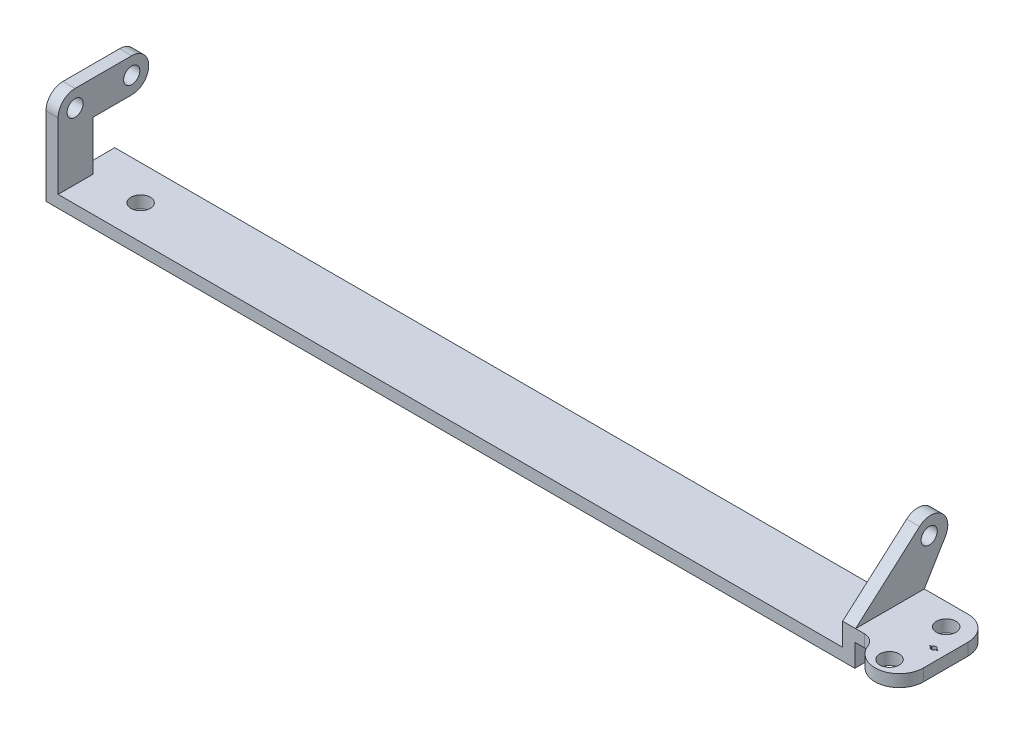
ISO-10303-21;
HEADER;
FILE_DESCRIPTION(('STEP AP214'),'2;1');
FILE_NAME('part.step','',(''),(''),'','','');
FILE_SCHEMA(('AUTOMOTIVE_DESIGN { 1 0 10303 214 1 1 1 1 }'));
ENDSEC;
DATA;
#1=APPLICATION_CONTEXT('core data for automotive mechanical design processes');
#2=APPLICATION_PROTOCOL_DEFINITION('international standard','automotive_design',2000,#1);
#3=PRODUCT_CONTEXT('',#1,'mechanical');
#4=PRODUCT('Part','Part','',(#3));
#5=PRODUCT_RELATED_PRODUCT_CATEGORY('part','',(#4));
#6=PRODUCT_DEFINITION_FORMATION('','',#4);
#7=PRODUCT_DEFINITION_CONTEXT('part definition',#1,'design');
#8=PRODUCT_DEFINITION('design','',#6,#7);
#9=PRODUCT_DEFINITION_SHAPE('','',#8);
#10=(LENGTH_UNIT() NAMED_UNIT(*) SI_UNIT(.MILLI.,.METRE.));
#11=(NAMED_UNIT(*) PLANE_ANGLE_UNIT() SI_UNIT($,.RADIAN.));
#12=(NAMED_UNIT(*) SI_UNIT($,.STERADIAN.) SOLID_ANGLE_UNIT());
#13=UNCERTAINTY_MEASURE_WITH_UNIT(LENGTH_MEASURE(1.E-05),#10,'distance_accuracy_value','');
#14=(GEOMETRIC_REPRESENTATION_CONTEXT(3) GLOBAL_UNCERTAINTY_ASSIGNED_CONTEXT((#13)) GLOBAL_UNIT_ASSIGNED_CONTEXT((#10,
#11,#12)) REPRESENTATION_CONTEXT('',''));
#15=CARTESIAN_POINT('',(0.,0.,0.));
#16=DIRECTION('',(0.,0.,1.));
#17=DIRECTION('',(1.,0.,0.));
#18=AXIS2_PLACEMENT_3D('',#15,#16,#17);
#19=CARTESIAN_POINT('',(1000.,43.,-85.));
#20=DIRECTION('',(0.,-1.,0.));
#21=DIRECTION('',(0.,0.,-1.));
#22=AXIS2_PLACEMENT_3D('',#19,#20,#21);
#23=PLANE('',#22);
#24=DIRECTION('',(-1.,0.,0.));
#25=VECTOR('',#24,1.);
#26=CARTESIAN_POINT('',(0.,43.,-28.));
#27=LINE('',#26,#25);
#28=CARTESIAN_POINT('',(1067.04196010845,43.,-28.));
#29=VERTEX_POINT('',#28);
#30=CARTESIAN_POINT('',(1065.,43.,-28.));
#31=VERTEX_POINT('',#30);
#32=EDGE_CURVE('E235',#29,#31,#27,.T.);
#33=ORIENTED_EDGE('',*,*,#32,.F.);
#34=CARTESIAN_POINT('',(1070.,43.,-27.5));
#35=DIRECTION('',(0.,1.,0.));
#36=DIRECTION('',(0.,0.,1.));
#37=AXIS2_PLACEMENT_3D('',#34,#35,#36);
#38=CIRCLE('',#37,2.99999999999993);
#39=CARTESIAN_POINT('',(1072.95803989155,43.,-28.));
#40=VERTEX_POINT('',#39);
#41=EDGE_CURVE('E48',#40,#29,#38,.T.);
#42=ORIENTED_EDGE('',*,*,#41,.F.);
#43=DIRECTION('',(-1.,0.,0.));
#44=VECTOR('',#43,1.);
#45=CARTESIAN_POINT('',(0.,43.,-28.));
#46=LINE('',#45,#44);
#47=CARTESIAN_POINT('',(1075.,43.,-28.));
#48=VERTEX_POINT('',#47);
#49=EDGE_CURVE('E256',#48,#40,#46,.T.);
#50=ORIENTED_EDGE('',*,*,#49,.F.);
#51=DIRECTION('',(0.,0.,1.));
#52=VECTOR('',#51,1.);
#53=CARTESIAN_POINT('',(1075.,43.,0.));
#54=LINE('',#53,#52);
#55=CARTESIAN_POINT('',(1075.,43.,-27.));
#56=VERTEX_POINT('',#55);
#57=EDGE_CURVE('E253',#48,#56,#54,.T.);
#58=ORIENTED_EDGE('',*,*,#57,.T.);
#59=DIRECTION('',(-1.,0.,0.));
#60=VECTOR('',#59,1.);
#61=CARTESIAN_POINT('',(0.,43.,-27.));
#62=LINE('',#61,#60);
#63=CARTESIAN_POINT('',(1072.95803989155,43.,-27.));
#64=VERTEX_POINT('',#63);
#65=EDGE_CURVE('E250',#56,#64,#62,.T.);
#66=ORIENTED_EDGE('',*,*,#65,.T.);
#67=CARTESIAN_POINT('',(1070.,43.,-27.5));
#68=DIRECTION('',(0.,1.,0.));
#69=DIRECTION('',(0.,0.,1.));
#70=AXIS2_PLACEMENT_3D('',#67,#68,#69);
#71=CIRCLE('',#70,2.99999999999993);
#72=CARTESIAN_POINT('',(1067.04196010845,43.,-27.));
#73=VERTEX_POINT('',#72);
#74=EDGE_CURVE('E244',#73,#64,#71,.T.);
#75=ORIENTED_EDGE('',*,*,#74,.F.);
#76=DIRECTION('',(-1.,0.,0.));
#77=VECTOR('',#76,1.);
#78=CARTESIAN_POINT('',(0.,43.,-27.));
#79=LINE('',#78,#77);
#80=CARTESIAN_POINT('',(1065.,43.,-27.));
#81=VERTEX_POINT('',#80);
#82=EDGE_CURVE('E242',#73,#81,#79,.T.);
#83=ORIENTED_EDGE('',*,*,#82,.T.);
#84=DIRECTION('',(0.,0.,1.));
#85=VECTOR('',#84,1.);
#86=CARTESIAN_POINT('',(1065.,43.,0.));
#87=LINE('',#86,#85);
#88=EDGE_CURVE('E226',#31,#81,#87,.T.);
#89=ORIENTED_EDGE('',*,*,#88,.F.);
#90=EDGE_LOOP('',(#33,#42,#50,#58,#66,#75,#83,#89));
#91=FACE_BOUND('',#90,.T.);
#92=CARTESIAN_POINT('',(1055.,43.,-58.));
#93=DIRECTION('',(0.,1.,0.));
#94=DIRECTION('',(0.,0.,1.));
#95=AXIS2_PLACEMENT_3D('',#92,#93,#94);
#96=CIRCLE('',#95,12.);
#97=CARTESIAN_POINT('',(1055.,43.,-46.));
#98=VERTEX_POINT('',#97);
#99=EDGE_CURVE('E289',#98,#98,#96,.T.);
#100=ORIENTED_EDGE('',*,*,#99,.F.);
#101=EDGE_LOOP('',(#100));
#102=FACE_BOUND('',#101,.T.);
#103=CARTESIAN_POINT('',(1055.,43.,12.));
#104=DIRECTION('',(0.,1.,0.));
#105=DIRECTION('',(0.,0.,1.));
#106=AXIS2_PLACEMENT_3D('',#103,#104,#105);
#107=CIRCLE('',#106,12.);
#108=CARTESIAN_POINT('',(1055.,43.,24.));
#109=VERTEX_POINT('',#108);
#110=EDGE_CURVE('E295',#109,#109,#107,.T.);
#111=ORIENTED_EDGE('',*,*,#110,.F.);
#112=EDGE_LOOP('',(#111));
#113=FACE_BOUND('',#112,.T.);
#114=DIRECTION('',(0.,0.,1.));
#115=VECTOR('',#114,1.);
#116=CARTESIAN_POINT('',(1085.,43.,-85.));
#117=LINE('',#116,#115);
#118=CARTESIAN_POINT('',(1085.,43.,-55.));
#119=VERTEX_POINT('',#118);
#120=CARTESIAN_POINT('',(1085.,43.,0.));
#121=VERTEX_POINT('',#120);
#122=EDGE_CURVE('E414',#119,#121,#117,.T.);
#123=ORIENTED_EDGE('',*,*,#122,.F.);
#124=CARTESIAN_POINT('',(1055.,43.,-55.));
#125=DIRECTION('',(0.,-1.,0.));
#126=DIRECTION('',(0.,0.,-1.));
#127=AXIS2_PLACEMENT_3D('',#124,#125,#126);
#128=CIRCLE('',#127,30.);
#129=CARTESIAN_POINT('',(1055.,43.,-85.));
#130=VERTEX_POINT('',#129);
#131=EDGE_CURVE('E460',#119,#130,#128,.F.);
#132=ORIENTED_EDGE('',*,*,#131,.T.);
#133=DIRECTION('',(1.,0.,0.));
#134=VECTOR('',#133,1.);
#135=CARTESIAN_POINT('',(1000.,43.,-85.));
#136=LINE('',#135,#134);
#137=CARTESIAN_POINT('',(1001.,43.,-85.));
#138=VERTEX_POINT('',#137);
#139=EDGE_CURVE('E363',#138,#130,#136,.T.);
#140=ORIENTED_EDGE('',*,*,#139,.F.);
#141=DIRECTION('',(0.,0.,1.));
#142=VECTOR('',#141,1.);
#143=CARTESIAN_POINT('',(1001.,43.,0.));
#144=LINE('',#143,#142);
#145=CARTESIAN_POINT('',(1001.,43.,0.));
#146=VERTEX_POINT('',#145);
#147=EDGE_CURVE('E306',#138,#146,#144,.T.);
#148=ORIENTED_EDGE('',*,*,#147,.T.);
#149=DIRECTION('',(1.,0.,0.));
#150=VECTOR('',#149,1.);
#151=CARTESIAN_POINT('',(1000.,43.,0.));
#152=LINE('',#151,#150);
#153=CARTESIAN_POINT('',(1011.8722826943,43.,0.));
#154=VERTEX_POINT('',#153);
#155=EDGE_CURVE('E386',#146,#154,#152,.T.);
#156=ORIENTED_EDGE('',*,*,#155,.T.);
#157=CARTESIAN_POINT('',(1011.8722826943,43.,16.));
#158=DIRECTION('',(0.,-1.,0.));
#159=DIRECTION('',(0.,0.,-1.));
#160=AXIS2_PLACEMENT_3D('',#157,#158,#159);
#161=CIRCLE('',#160,16.);
#162=CARTESIAN_POINT('',(1026.87322784411,43.,10.4347826086957));
#163=VERTEX_POINT('',#162);
#164=EDGE_CURVE('E445',#154,#163,#161,.T.);
#165=ORIENTED_EDGE('',*,*,#164,.T.);
#166=CARTESIAN_POINT('',(1055.,43.,0.));
#167=DIRECTION('',(0.,1.,0.));
#168=DIRECTION('',(0.,0.,-1.));
#169=AXIS2_PLACEMENT_3D('',#166,#167,#168);
#170=CIRCLE('',#169,30.);
#171=EDGE_CURVE('E299',#163,#121,#170,.T.);
#172=ORIENTED_EDGE('',*,*,#171,.T.);
#173=EDGE_LOOP('',(#123,#132,#140,#148,#156,#165,#172));
#174=FACE_BOUND('',#173,.T.);
#175=ADVANCED_FACE('F33',(#91,#102,#113,#174),#23,.F.);
#176=CARTESIAN_POINT('',(1000.,28.,-85.));
#177=DIRECTION('',(0.,-1.,0.));
#178=DIRECTION('',(0.,0.,-1.));
#179=AXIS2_PLACEMENT_3D('',#176,#177,#178);
#180=PLANE('',#179);
#181=CARTESIAN_POINT('',(1070.,28.,-27.5));
#182=DIRECTION('',(0.,-1.,0.));
#183=DIRECTION('',(0.,0.,-1.));
#184=AXIS2_PLACEMENT_3D('',#181,#182,#183);
#185=CIRCLE('',#184,2.99999999999993);
#186=CARTESIAN_POINT('',(1067.04196010845,28.,-28.));
#187=VERTEX_POINT('',#186);
#188=CARTESIAN_POINT('',(1072.95803989155,28.,-28.));
#189=VERTEX_POINT('',#188);
#190=EDGE_CURVE('E11',#187,#189,#185,.T.);
#191=ORIENTED_EDGE('',*,*,#190,.F.);
#192=DIRECTION('',(1.,0.,0.));
#193=VECTOR('',#192,1.);
#194=CARTESIAN_POINT('',(1000.,28.,-28.));
#195=LINE('',#194,#193);
#196=CARTESIAN_POINT('',(1065.,28.,-28.));
#197=VERTEX_POINT('',#196);
#198=EDGE_CURVE('E462',#197,#187,#195,.T.);
#199=ORIENTED_EDGE('',*,*,#198,.F.);
#200=DIRECTION('',(0.,0.,-1.));
#201=VECTOR('',#200,1.);
#202=CARTESIAN_POINT('',(1065.,28.,-85.));
#203=LINE('',#202,#201);
#204=CARTESIAN_POINT('',(1065.,28.,-27.));
#205=VERTEX_POINT('',#204);
#206=EDGE_CURVE('E229',#205,#197,#203,.T.);
#207=ORIENTED_EDGE('',*,*,#206,.F.);
#208=DIRECTION('',(1.,0.,0.));
#209=VECTOR('',#208,1.);
#210=CARTESIAN_POINT('',(1000.,28.,-27.));
#211=LINE('',#210,#209);
#212=CARTESIAN_POINT('',(1067.04196010845,28.,-27.));
#213=VERTEX_POINT('',#212);
#214=EDGE_CURVE('E469',#205,#213,#211,.T.);
#215=ORIENTED_EDGE('',*,*,#214,.T.);
#216=CARTESIAN_POINT('',(1070.,28.,-27.5));
#217=DIRECTION('',(0.,-1.,0.));
#218=DIRECTION('',(0.,0.,-1.));
#219=AXIS2_PLACEMENT_3D('',#216,#217,#218);
#220=CIRCLE('',#219,2.99999999999993);
#221=CARTESIAN_POINT('',(1072.95803989155,28.,-27.));
#222=VERTEX_POINT('',#221);
#223=EDGE_CURVE('E472',#222,#213,#220,.T.);
#224=ORIENTED_EDGE('',*,*,#223,.F.);
#225=DIRECTION('',(1.,0.,0.));
#226=VECTOR('',#225,1.);
#227=CARTESIAN_POINT('',(1000.,28.,-27.));
#228=LINE('',#227,#226);
#229=CARTESIAN_POINT('',(1075.,28.,-27.));
#230=VERTEX_POINT('',#229);
#231=EDGE_CURVE('E474',#222,#230,#228,.T.);
#232=ORIENTED_EDGE('',*,*,#231,.T.);
#233=DIRECTION('',(0.,0.,-1.));
#234=VECTOR('',#233,1.);
#235=CARTESIAN_POINT('',(1075.,28.,-85.));
#236=LINE('',#235,#234);
#237=CARTESIAN_POINT('',(1075.,28.,-28.));
#238=VERTEX_POINT('',#237);
#239=EDGE_CURVE('E477',#230,#238,#236,.T.);
#240=ORIENTED_EDGE('',*,*,#239,.T.);
#241=DIRECTION('',(1.,0.,0.));
#242=VECTOR('',#241,1.);
#243=CARTESIAN_POINT('',(1000.,28.,-28.));
#244=LINE('',#243,#242);
#245=EDGE_CURVE('E41',#189,#238,#244,.T.);
#246=ORIENTED_EDGE('',*,*,#245,.F.);
#247=EDGE_LOOP('',(#191,#199,#207,#215,#224,#232,#240,#246));
#248=FACE_BOUND('',#247,.T.);
#249=CARTESIAN_POINT('',(1055.,28.,-58.));
#250=DIRECTION('',(0.,-1.,0.));
#251=DIRECTION('',(0.,0.,-1.));
#252=AXIS2_PLACEMENT_3D('',#249,#250,#251);
#253=CIRCLE('',#252,12.);
#254=CARTESIAN_POINT('',(1055.,28.,-70.));
#255=VERTEX_POINT('',#254);
#256=EDGE_CURVE('E294',#255,#255,#253,.T.);
#257=ORIENTED_EDGE('',*,*,#256,.F.);
#258=EDGE_LOOP('',(#257));
#259=FACE_BOUND('',#258,.T.);
#260=CARTESIAN_POINT('',(1055.,28.,12.));
#261=DIRECTION('',(0.,-1.,0.));
#262=DIRECTION('',(0.,0.,-1.));
#263=AXIS2_PLACEMENT_3D('',#260,#261,#262);
#264=CIRCLE('',#263,12.);
#265=CARTESIAN_POINT('',(1055.,28.,0.));
#266=VERTEX_POINT('',#265);
#267=EDGE_CURVE('E298',#266,#266,#264,.T.);
#268=ORIENTED_EDGE('',*,*,#267,.F.);
#269=EDGE_LOOP('',(#268));
#270=FACE_BOUND('',#269,.T.);
#271=DIRECTION('',(1.,0.,0.));
#272=VECTOR('',#271,1.);
#273=CARTESIAN_POINT('',(1000.,28.,-85.));
#274=LINE('',#273,#272);
#275=CARTESIAN_POINT('',(1000.,28.,-85.));
#276=VERTEX_POINT('',#275);
#277=CARTESIAN_POINT('',(1055.,28.,-85.));
#278=VERTEX_POINT('',#277);
#279=EDGE_CURVE('E360',#276,#278,#274,.T.);
#280=ORIENTED_EDGE('',*,*,#279,.T.);
#281=CARTESIAN_POINT('',(1055.,28.,-55.));
#282=DIRECTION('',(0.,-1.,0.));
#283=DIRECTION('',(0.,0.,-1.));
#284=AXIS2_PLACEMENT_3D('',#281,#282,#283);
#285=CIRCLE('',#284,30.);
#286=CARTESIAN_POINT('',(1085.,28.,-55.));
#287=VERTEX_POINT('',#286);
#288=EDGE_CURVE('E456',#278,#287,#285,.T.);
#289=ORIENTED_EDGE('',*,*,#288,.T.);
#290=DIRECTION('',(0.,0.,1.));
#291=VECTOR('',#290,1.);
#292=CARTESIAN_POINT('',(1085.,28.,-85.));
#293=LINE('',#292,#291);
#294=CARTESIAN_POINT('',(1085.,28.,0.));
#295=VERTEX_POINT('',#294);
#296=EDGE_CURVE('E380',#287,#295,#293,.T.);
#297=ORIENTED_EDGE('',*,*,#296,.T.);
#298=CARTESIAN_POINT('',(1055.,28.,0.));
#299=DIRECTION('',(0.,-1.,0.));
#300=DIRECTION('',(0.,0.,-1.));
#301=AXIS2_PLACEMENT_3D('',#298,#299,#300);
#302=CIRCLE('',#301,30.);
#303=CARTESIAN_POINT('',(1026.87322784411,28.,10.4347826086957));
#304=VERTEX_POINT('',#303);
#305=EDGE_CURVE('E302',#304,#295,#302,.F.);
#306=ORIENTED_EDGE('',*,*,#305,.F.);
#307=CARTESIAN_POINT('',(1011.8722826943,28.,16.));
#308=DIRECTION('',(0.,-1.,0.));
#309=DIRECTION('',(0.,0.,-1.));
#310=AXIS2_PLACEMENT_3D('',#307,#308,#309);
#311=CIRCLE('',#310,16.);
#312=CARTESIAN_POINT('',(1011.8722826943,28.,0.));
#313=VERTEX_POINT('',#312);
#314=EDGE_CURVE('E447',#304,#313,#311,.F.);
#315=ORIENTED_EDGE('',*,*,#314,.T.);
#316=DIRECTION('',(1.,0.,0.));
#317=VECTOR('',#316,1.);
#318=CARTESIAN_POINT('',(1000.,28.,0.));
#319=LINE('',#318,#317);
#320=CARTESIAN_POINT('',(1000.,28.,0.));
#321=VERTEX_POINT('',#320);
#322=EDGE_CURVE('E357',#321,#313,#319,.T.);
#323=ORIENTED_EDGE('',*,*,#322,.F.);
#324=DIRECTION('',(0.,0.,1.));
#325=VECTOR('',#324,1.);
#326=CARTESIAN_POINT('',(1000.,28.,-85.));
#327=LINE('',#326,#325);
#328=EDGE_CURVE('E402',#276,#321,#327,.T.);
#329=ORIENTED_EDGE('',*,*,#328,.F.);
#330=EDGE_LOOP('',(#280,#289,#297,#306,#315,#323,#329));
#331=FACE_BOUND('',#330,.T.);
#332=ADVANCED_FACE('F491',(#248,#259,#270,#331),#180,.T.);
#333=CARTESIAN_POINT('',(1000.,0.,-85.));
#334=DIRECTION('',(1.,0.,0.));
#335=DIRECTION('',(0.,0.,-1.));
#336=AXIS2_PLACEMENT_3D('',#333,#334,#335);
#337=PLANE('',#336);
#338=DIRECTION('',(0.,1.,0.));
#339=VECTOR('',#338,1.);
#340=CARTESIAN_POINT('',(1000.,0.,0.));
#341=LINE('',#340,#339);
#342=CARTESIAN_POINT('',(1000.,0.,0.));
#343=VERTEX_POINT('',#342);
#344=EDGE_CURVE('E364',#343,#321,#341,.T.);
#345=ORIENTED_EDGE('',*,*,#344,.F.);
#346=DIRECTION('',(0.,0.,1.));
#347=VECTOR('',#346,1.);
#348=CARTESIAN_POINT('',(1000.,0.,-85.));
#349=LINE('',#348,#347);
#350=CARTESIAN_POINT('',(1000.,0.,-85.));
#351=VERTEX_POINT('',#350);
#352=EDGE_CURVE('E405',#351,#343,#349,.T.);
#353=ORIENTED_EDGE('',*,*,#352,.F.);
#354=DIRECTION('',(0.,1.,0.));
#355=VECTOR('',#354,1.);
#356=CARTESIAN_POINT('',(1000.,0.,-85.));
#357=LINE('',#356,#355);
#358=EDGE_CURVE('E377',#351,#276,#357,.T.);
#359=ORIENTED_EDGE('',*,*,#358,.T.);
#360=ORIENTED_EDGE('',*,*,#328,.T.);
#361=EDGE_LOOP('',(#345,#353,#359,#360));
#362=FACE_BOUND('',#361,.T.);
#363=ADVANCED_FACE('F521',(#362),#337,.T.);
#364=CARTESIAN_POINT('',(0.,0.,-85.));
#365=DIRECTION('',(0.,-1.,0.));
#366=DIRECTION('',(0.,0.,-1.));
#367=AXIS2_PLACEMENT_3D('',#364,#365,#366);
#368=PLANE('',#367);
#369=CARTESIAN_POINT('',(75.,0.,-42.));
#370=DIRECTION('',(0.,1.,0.));
#371=DIRECTION('',(0.,0.,1.));
#372=AXIS2_PLACEMENT_3D('',#369,#370,#371);
#373=CIRCLE('',#372,12.);
#374=CARTESIAN_POINT('',(75.,0.,-30.));
#375=VERTEX_POINT('',#374);
#376=EDGE_CURVE('E286',#375,#375,#373,.T.);
#377=ORIENTED_EDGE('',*,*,#376,.T.);
#378=EDGE_LOOP('',(#377));
#379=FACE_BOUND('',#378,.T.);
#380=DIRECTION('',(1.,0.,0.));
#381=VECTOR('',#380,1.);
#382=CARTESIAN_POINT('',(0.,0.,0.));
#383=LINE('',#382,#381);
#384=CARTESIAN_POINT('',(0.,0.,0.));
#385=VERTEX_POINT('',#384);
#386=EDGE_CURVE('E397',#385,#343,#383,.T.);
#387=ORIENTED_EDGE('',*,*,#386,.F.);
#388=DIRECTION('',(0.,0.,1.));
#389=VECTOR('',#388,1.);
#390=CARTESIAN_POINT('',(0.,0.,-85.));
#391=LINE('',#390,#389);
#392=CARTESIAN_POINT('',(0.,0.,-85.));
#393=VERTEX_POINT('',#392);
#394=EDGE_CURVE('E407',#393,#385,#391,.T.);
#395=ORIENTED_EDGE('',*,*,#394,.F.);
#396=DIRECTION('',(1.,0.,0.));
#397=VECTOR('',#396,1.);
#398=CARTESIAN_POINT('',(0.,0.,-85.));
#399=LINE('',#398,#397);
#400=EDGE_CURVE('E374',#393,#351,#399,.T.);
#401=ORIENTED_EDGE('',*,*,#400,.T.);
#402=ORIENTED_EDGE('',*,*,#352,.T.);
#403=EDGE_LOOP('',(#387,#395,#401,#402));
#404=FACE_BOUND('',#403,.T.);
#405=ADVANCED_FACE('F631',(#379,#404),#368,.T.);
#406=CARTESIAN_POINT('',(0.,0.,-85.));
#407=DIRECTION('',(1.,0.,0.));
#408=DIRECTION('',(0.,0.,-1.));
#409=AXIS2_PLACEMENT_3D('',#406,#407,#408);
#410=PLANE('',#409);
#411=CARTESIAN_POINT('',(0.,97.,-21.));
#412=DIRECTION('',(-1.,0.,0.));
#413=DIRECTION('',(0.,0.,1.));
#414=AXIS2_PLACEMENT_3D('',#411,#412,#413);
#415=CIRCLE('',#414,10.);
#416=CARTESIAN_POINT('',(0.,97.,-11.));
#417=VERTEX_POINT('',#416);
#418=EDGE_CURVE('E261',#417,#417,#415,.T.);
#419=ORIENTED_EDGE('',*,*,#418,.F.);
#420=EDGE_LOOP('',(#419));
#421=FACE_BOUND('',#420,.T.);
#422=CARTESIAN_POINT('',(0.,97.,-91.));
#423=DIRECTION('',(-1.,0.,0.));
#424=DIRECTION('',(0.,0.,1.));
#425=AXIS2_PLACEMENT_3D('',#422,#423,#424);
#426=CIRCLE('',#425,9.99999999999999);
#427=CARTESIAN_POINT('',(0.,97.,-81.));
#428=VERTEX_POINT('',#427);
#429=EDGE_CURVE('E275',#428,#428,#426,.T.);
#430=ORIENTED_EDGE('',*,*,#429,.F.);
#431=EDGE_LOOP('',(#430));
#432=FACE_BOUND('',#431,.T.);
#433=CARTESIAN_POINT('',(0.,97.,-91.));
#434=DIRECTION('',(1.,0.,0.));
#435=DIRECTION('',(0.,0.,-1.));
#436=AXIS2_PLACEMENT_3D('',#433,#434,#435);
#437=CIRCLE('',#436,21.);
#438=CARTESIAN_POINT('',(0.,118.,-91.));
#439=VERTEX_POINT('',#438);
#440=CARTESIAN_POINT('',(0.,97.,-112.));
#441=VERTEX_POINT('',#440);
#442=EDGE_CURVE('E418',#439,#441,#437,.F.);
#443=ORIENTED_EDGE('',*,*,#442,.T.);
#444=CARTESIAN_POINT('',(0.,97.,-91.));
#445=DIRECTION('',(1.,0.,0.));
#446=DIRECTION('',(0.,0.,-1.));
#447=AXIS2_PLACEMENT_3D('',#444,#445,#446);
#448=CIRCLE('',#447,21.);
#449=CARTESIAN_POINT('',(0.,76.,-91.));
#450=VERTEX_POINT('',#449);
#451=EDGE_CURVE('E420',#441,#450,#448,.F.);
#452=ORIENTED_EDGE('',*,*,#451,.T.);
#453=DIRECTION('',(0.,0.,1.));
#454=VECTOR('',#453,1.);
#455=CARTESIAN_POINT('',(0.,76.,-112.));
#456=LINE('',#455,#454);
#457=CARTESIAN_POINT('',(0.,76.,-43.));
#458=VERTEX_POINT('',#457);
#459=EDGE_CURVE('E350',#450,#458,#456,.T.);
#460=ORIENTED_EDGE('',*,*,#459,.T.);
#461=DIRECTION('',(0.,-1.,0.));
#462=VECTOR('',#461,1.);
#463=CARTESIAN_POINT('',(0.,76.,-43.));
#464=LINE('',#463,#462);
#465=CARTESIAN_POINT('',(0.,15.,-43.));
#466=VERTEX_POINT('',#465);
#467=EDGE_CURVE('E336',#458,#466,#464,.T.);
#468=ORIENTED_EDGE('',*,*,#467,.T.);
#469=DIRECTION('',(0.,0.,1.));
#470=VECTOR('',#469,1.);
#471=CARTESIAN_POINT('',(0.,15.,-85.));
#472=LINE('',#471,#470);
#473=CARTESIAN_POINT('',(0.,15.,-85.));
#474=VERTEX_POINT('',#473);
#475=EDGE_CURVE('E409',#474,#466,#472,.T.);
#476=ORIENTED_EDGE('',*,*,#475,.F.);
#477=DIRECTION('',(0.,1.,0.));
#478=VECTOR('',#477,1.);
#479=CARTESIAN_POINT('',(0.,0.,-85.));
#480=LINE('',#479,#478);
#481=EDGE_CURVE('E372',#393,#474,#480,.T.);
#482=ORIENTED_EDGE('',*,*,#481,.F.);
#483=ORIENTED_EDGE('',*,*,#394,.T.);
#484=DIRECTION('',(0.,1.,0.));
#485=VECTOR('',#484,1.);
#486=CARTESIAN_POINT('',(0.,0.,0.));
#487=LINE('',#486,#485);
#488=CARTESIAN_POINT('',(0.,97.,0.));
#489=VERTEX_POINT('',#488);
#490=EDGE_CURVE('E394',#385,#489,#487,.T.);
#491=ORIENTED_EDGE('',*,*,#490,.T.);
#492=CARTESIAN_POINT('',(0.,97.,-21.));
#493=DIRECTION('',(1.,0.,0.));
#494=DIRECTION('',(0.,0.,-1.));
#495=AXIS2_PLACEMENT_3D('',#492,#493,#494);
#496=CIRCLE('',#495,21.);
#497=CARTESIAN_POINT('',(0.,118.,-21.));
#498=VERTEX_POINT('',#497);
#499=EDGE_CURVE('E404',#489,#498,#496,.F.);
#500=ORIENTED_EDGE('',*,*,#499,.T.);
#501=DIRECTION('',(0.,0.,-1.));
#502=VECTOR('',#501,1.);
#503=CARTESIAN_POINT('',(0.,118.,0.));
#504=LINE('',#503,#502);
#505=EDGE_CURVE('E330',#498,#439,#504,.T.);
#506=ORIENTED_EDGE('',*,*,#505,.T.);
#507=EDGE_LOOP('',(#443,#452,#460,#468,#476,#482,#483,#491,#500,#506));
#508=FACE_BOUND('',#507,.T.);
#509=ADVANCED_FACE('F608',(#421,#432,#508),#410,.F.);
#510=CARTESIAN_POINT('',(0.,15.,-85.));
#511=DIRECTION('',(0.,-1.,0.));
#512=DIRECTION('',(0.,0.,-1.));
#513=AXIS2_PLACEMENT_3D('',#510,#511,#512);
#514=PLANE('',#513);
#515=CARTESIAN_POINT('',(75.,15.,-42.));
#516=DIRECTION('',(0.,1.,0.));
#517=DIRECTION('',(0.,0.,1.));
#518=AXIS2_PLACEMENT_3D('',#515,#516,#517);
#519=CIRCLE('',#518,12.);
#520=CARTESIAN_POINT('',(75.,15.,-30.));
#521=VERTEX_POINT('',#520);
#522=EDGE_CURVE('E285',#521,#521,#519,.T.);
#523=ORIENTED_EDGE('',*,*,#522,.F.);
#524=EDGE_LOOP('',(#523));
#525=FACE_BOUND('',#524,.T.);
#526=ORIENTED_EDGE('',*,*,#475,.T.);
#527=DIRECTION('',(-1.,0.,0.));
#528=VECTOR('',#527,1.);
#529=CARTESIAN_POINT('',(15.,15.,-43.));
#530=LINE('',#529,#528);
#531=CARTESIAN_POINT('',(15.,15.,-43.));
#532=VERTEX_POINT('',#531);
#533=EDGE_CURVE('E354',#532,#466,#530,.T.);
#534=ORIENTED_EDGE('',*,*,#533,.F.);
#535=DIRECTION('',(0.,0.,1.));
#536=VECTOR('',#535,1.);
#537=CARTESIAN_POINT('',(15.,15.,-43.));
#538=LINE('',#537,#536);
#539=CARTESIAN_POINT('',(15.,15.,0.));
#540=VERTEX_POINT('',#539);
#541=EDGE_CURVE('E332',#532,#540,#538,.T.);
#542=ORIENTED_EDGE('',*,*,#541,.T.);
#543=DIRECTION('',(1.,0.,0.));
#544=VECTOR('',#543,1.);
#545=CARTESIAN_POINT('',(0.,15.,0.));
#546=LINE('',#545,#544);
#547=CARTESIAN_POINT('',(985.,15.,0.));
#548=VERTEX_POINT('',#547);
#549=EDGE_CURVE('E392',#540,#548,#546,.T.);
#550=ORIENTED_EDGE('',*,*,#549,.T.);
#551=DIRECTION('',(0.,0.,1.));
#552=VECTOR('',#551,1.);
#553=CARTESIAN_POINT('',(985.,15.,-85.));
#554=LINE('',#553,#552);
#555=CARTESIAN_POINT('',(985.,15.,-85.));
#556=VERTEX_POINT('',#555);
#557=EDGE_CURVE('E411',#556,#548,#554,.T.);
#558=ORIENTED_EDGE('',*,*,#557,.F.);
#559=DIRECTION('',(1.,0.,0.));
#560=VECTOR('',#559,1.);
#561=CARTESIAN_POINT('',(0.,15.,-85.));
#562=LINE('',#561,#560);
#563=EDGE_CURVE('E370',#474,#556,#562,.T.);
#564=ORIENTED_EDGE('',*,*,#563,.F.);
#565=EDGE_LOOP('',(#526,#534,#542,#550,#558,#564));
#566=FACE_BOUND('',#565,.T.);
#567=ADVANCED_FACE('F599',(#525,#566),#514,.F.);
#568=CARTESIAN_POINT('',(985.,0.,-85.));
#569=DIRECTION('',(1.,0.,0.));
#570=DIRECTION('',(0.,0.,-1.));
#571=AXIS2_PLACEMENT_3D('',#568,#569,#570);
#572=PLANE('',#571);
#573=CARTESIAN_POINT('',(985.,97.,-91.));
#574=DIRECTION('',(1.,0.,0.));
#575=DIRECTION('',(0.,0.,-1.));
#576=AXIS2_PLACEMENT_3D('',#573,#574,#575);
#577=CIRCLE('',#576,9.99999999999999);
#578=CARTESIAN_POINT('',(985.,97.,-101.));
#579=VERTEX_POINT('',#578);
#580=EDGE_CURVE('E282',#579,#579,#577,.T.);
#581=ORIENTED_EDGE('',*,*,#580,.T.);
#582=EDGE_LOOP('',(#581));
#583=FACE_BOUND('',#582,.T.);
#584=DIRECTION('',(0.,1.,0.));
#585=VECTOR('',#584,1.);
#586=CARTESIAN_POINT('',(985.,0.,0.));
#587=LINE('',#586,#585);
#588=CARTESIAN_POINT('',(985.,43.,0.));
#589=VERTEX_POINT('',#588);
#590=EDGE_CURVE('E390',#548,#589,#587,.T.);
#591=ORIENTED_EDGE('',*,*,#590,.T.);
#592=DIRECTION('',(0.,0.66134027231509,-0.750086024542654));
#593=VECTOR('',#592,1.);
#594=CARTESIAN_POINT('',(985.,43.,0.));
#595=LINE('',#594,#593);
#596=CARTESIAN_POINT('',(985.,112.751806515396,-79.1118542813831));
#597=VERTEX_POINT('',#596);
#598=EDGE_CURVE('E320',#589,#597,#595,.T.);
#599=ORIENTED_EDGE('',*,*,#598,.T.);
#600=CARTESIAN_POINT('',(985.,97.,-93.));
#601=DIRECTION('',(-1.,0.,0.));
#602=DIRECTION('',(0.,0.,1.));
#603=AXIS2_PLACEMENT_3D('',#600,#601,#602);
#604=CIRCLE('',#603,21.);
#605=CARTESIAN_POINT('',(985.,86.1680313939949,-110.990788090535));
#606=VERTEX_POINT('',#605);
#607=EDGE_CURVE('E323',#597,#606,#604,.T.);
#608=ORIENTED_EDGE('',*,*,#607,.T.);
#609=DIRECTION('',(0.,-0.856704194787359,0.515808028857386));
#610=VECTOR('',#609,1.);
#611=CARTESIAN_POINT('',(985.,86.1680313939949,-110.990788090535));
#612=LINE('',#611,#610);
#613=CARTESIAN_POINT('',(985.,43.,-85.));
#614=VERTEX_POINT('',#613);
#615=EDGE_CURVE('E310',#606,#614,#612,.T.);
#616=ORIENTED_EDGE('',*,*,#615,.T.);
#617=DIRECTION('',(0.,1.,0.));
#618=VECTOR('',#617,1.);
#619=CARTESIAN_POINT('',(985.,0.,-85.));
#620=LINE('',#619,#618);
#621=EDGE_CURVE('E368',#556,#614,#620,.T.);
#622=ORIENTED_EDGE('',*,*,#621,.F.);
#623=ORIENTED_EDGE('',*,*,#557,.T.);
#624=EDGE_LOOP('',(#591,#599,#608,#616,#622,#623));
#625=FACE_BOUND('',#624,.T.);
#626=ADVANCED_FACE('F525',(#583,#625),#572,.F.);
#627=CARTESIAN_POINT('',(1085.,43.,-85.));
#628=DIRECTION('',(-1.,0.,0.));
#629=DIRECTION('',(0.,0.,1.));
#630=AXIS2_PLACEMENT_3D('',#627,#628,#629);
#631=PLANE('',#630);
#632=ORIENTED_EDGE('',*,*,#296,.F.);
#633=DIRECTION('',(0.,-1.,0.));
#634=VECTOR('',#633,1.);
#635=CARTESIAN_POINT('',(1085.,43.,-55.));
#636=LINE('',#635,#634);
#637=EDGE_CURVE('E458',#287,#119,#636,.F.);
#638=ORIENTED_EDGE('',*,*,#637,.T.);
#639=ORIENTED_EDGE('',*,*,#122,.T.);
#640=DIRECTION('',(0.,-1.,0.));
#641=VECTOR('',#640,1.);
#642=CARTESIAN_POINT('',(1085.,43.,0.));
#643=LINE('',#642,#641);
#644=EDGE_CURVE('E383',#121,#295,#643,.T.);
#645=ORIENTED_EDGE('',*,*,#644,.T.);
#646=EDGE_LOOP('',(#632,#638,#639,#645));
#647=FACE_BOUND('',#646,.T.);
#648=ADVANCED_FACE('F527',(#647),#631,.F.);
#649=CARTESIAN_POINT('',(0.,0.,-85.));
#650=DIRECTION('',(0.,0.,-1.));
#651=DIRECTION('',(-1.,0.,0.));
#652=AXIS2_PLACEMENT_3D('',#649,#650,#651);
#653=PLANE('',#652);
#654=ORIENTED_EDGE('',*,*,#139,.T.);
#655=DIRECTION('',(0.,-1.,0.));
#656=VECTOR('',#655,1.);
#657=CARTESIAN_POINT('',(1055.,28.,-85.));
#658=LINE('',#657,#656);
#659=EDGE_CURVE('E449',#130,#278,#658,.T.);
#660=ORIENTED_EDGE('',*,*,#659,.T.);
#661=ORIENTED_EDGE('',*,*,#279,.F.);
#662=ORIENTED_EDGE('',*,*,#358,.F.);
#663=ORIENTED_EDGE('',*,*,#400,.F.);
#664=ORIENTED_EDGE('',*,*,#481,.T.);
#665=ORIENTED_EDGE('',*,*,#563,.T.);
#666=ORIENTED_EDGE('',*,*,#621,.T.);
#667=EDGE_CURVE('E365',#614,#138,#136,.T.);
#668=ORIENTED_EDGE('',*,*,#667,.T.);
#669=EDGE_LOOP('',(#654,#660,#661,#662,#663,#664,#665,#666,#668));
#670=FACE_BOUND('',#669,.T.);
#671=ADVANCED_FACE('F529',(#670),#653,.T.);
#672=CARTESIAN_POINT('',(0.,0.,0.));
#673=DIRECTION('',(0.,0.,-1.));
#674=DIRECTION('',(-1.,0.,0.));
#675=AXIS2_PLACEMENT_3D('',#672,#673,#674);
#676=PLANE('',#675);
#677=ORIENTED_EDGE('',*,*,#322,.T.);
#678=DIRECTION('',(0.,1.,0.));
#679=VECTOR('',#678,1.);
#680=CARTESIAN_POINT('',(1011.8722826943,0.,0.));
#681=LINE('',#680,#679);
#682=EDGE_CURVE('E438',#313,#154,#681,.T.);
#683=ORIENTED_EDGE('',*,*,#682,.T.);
#684=ORIENTED_EDGE('',*,*,#155,.F.);
#685=EDGE_CURVE('E387',#589,#146,#152,.T.);
#686=ORIENTED_EDGE('',*,*,#685,.F.);
#687=ORIENTED_EDGE('',*,*,#590,.F.);
#688=ORIENTED_EDGE('',*,*,#549,.F.);
#689=DIRECTION('',(0.,1.,0.));
#690=VECTOR('',#689,1.);
#691=CARTESIAN_POINT('',(15.,15.,0.));
#692=LINE('',#691,#690);
#693=CARTESIAN_POINT('',(15.,97.,0.));
#694=VERTEX_POINT('',#693);
#695=EDGE_CURVE('E335',#540,#694,#692,.T.);
#696=ORIENTED_EDGE('',*,*,#695,.T.);
#697=DIRECTION('',(-1.,0.,0.));
#698=VECTOR('',#697,1.);
#699=CARTESIAN_POINT('',(0.,97.,0.));
#700=LINE('',#699,#698);
#701=EDGE_CURVE('E435',#694,#489,#700,.T.);
#702=ORIENTED_EDGE('',*,*,#701,.T.);
#703=ORIENTED_EDGE('',*,*,#490,.F.);
#704=ORIENTED_EDGE('',*,*,#386,.T.);
#705=ORIENTED_EDGE('',*,*,#344,.T.);
#706=EDGE_LOOP('',(#677,#683,#684,#686,#687,#688,#696,#702,#703,#704,#705));
#707=FACE_BOUND('',#706,.T.);
#708=ADVANCED_FACE('F565',(#707),#676,.F.);
#709=CARTESIAN_POINT('',(15.,76.,-43.));
#710=DIRECTION('',(0.,0.,-1.));
#711=DIRECTION('',(0.,1.,0.));
#712=AXIS2_PLACEMENT_3D('',#709,#710,#711);
#713=PLANE('',#712);
#714=ORIENTED_EDGE('',*,*,#467,.F.);
#715=DIRECTION('',(-1.,0.,0.));
#716=VECTOR('',#715,1.);
#717=CARTESIAN_POINT('',(15.,76.,-43.));
#718=LINE('',#717,#716);
#719=CARTESIAN_POINT('',(15.,76.,-43.));
#720=VERTEX_POINT('',#719);
#721=EDGE_CURVE('E347',#720,#458,#718,.T.);
#722=ORIENTED_EDGE('',*,*,#721,.F.);
#723=DIRECTION('',(0.,-1.,0.));
#724=VECTOR('',#723,1.);
#725=CARTESIAN_POINT('',(15.,76.,-43.));
#726=LINE('',#725,#724);
#727=EDGE_CURVE('E344',#720,#532,#726,.T.);
#728=ORIENTED_EDGE('',*,*,#727,.T.);
#729=ORIENTED_EDGE('',*,*,#533,.T.);
#730=EDGE_LOOP('',(#714,#722,#728,#729));
#731=FACE_BOUND('',#730,.T.);
#732=ADVANCED_FACE('F627',(#731),#713,.T.);
#733=CARTESIAN_POINT('',(15.,76.,-112.));
#734=DIRECTION('',(0.,-1.,0.));
#735=DIRECTION('',(0.,0.,-1.));
#736=AXIS2_PLACEMENT_3D('',#733,#734,#735);
#737=PLANE('',#736);
#738=ORIENTED_EDGE('',*,*,#459,.F.);
#739=DIRECTION('',(-1.,0.,0.));
#740=VECTOR('',#739,1.);
#741=CARTESIAN_POINT('',(15.,76.,-91.));
#742=LINE('',#741,#740);
#743=CARTESIAN_POINT('',(15.,76.,-91.));
#744=VERTEX_POINT('',#743);
#745=EDGE_CURVE('E422',#450,#744,#742,.F.);
#746=ORIENTED_EDGE('',*,*,#745,.T.);
#747=DIRECTION('',(0.,0.,1.));
#748=VECTOR('',#747,1.);
#749=CARTESIAN_POINT('',(15.,76.,-112.));
#750=LINE('',#749,#748);
#751=EDGE_CURVE('E342',#744,#720,#750,.T.);
#752=ORIENTED_EDGE('',*,*,#751,.T.);
#753=ORIENTED_EDGE('',*,*,#721,.T.);
#754=EDGE_LOOP('',(#738,#746,#752,#753));
#755=FACE_BOUND('',#754,.T.);
#756=ADVANCED_FACE('F620',(#755),#737,.T.);
#757=CARTESIAN_POINT('',(15.,118.,0.));
#758=DIRECTION('',(0.,1.,0.));
#759=DIRECTION('',(0.,0.,1.));
#760=AXIS2_PLACEMENT_3D('',#757,#758,#759);
#761=PLANE('',#760);
#762=DIRECTION('',(0.,0.,-1.));
#763=VECTOR('',#762,1.);
#764=CARTESIAN_POINT('',(15.,118.,0.));
#765=LINE('',#764,#763);
#766=CARTESIAN_POINT('',(15.,118.,-21.));
#767=VERTEX_POINT('',#766);
#768=CARTESIAN_POINT('',(15.,118.,-91.));
#769=VERTEX_POINT('',#768);
#770=EDGE_CURVE('E339',#767,#769,#765,.T.);
#771=ORIENTED_EDGE('',*,*,#770,.T.);
#772=DIRECTION('',(-1.,0.,0.));
#773=VECTOR('',#772,1.);
#774=CARTESIAN_POINT('',(15.,118.,-91.));
#775=LINE('',#774,#773);
#776=EDGE_CURVE('E433',#769,#439,#775,.T.);
#777=ORIENTED_EDGE('',*,*,#776,.T.);
#778=ORIENTED_EDGE('',*,*,#505,.F.);
#779=DIRECTION('',(-1.,0.,0.));
#780=VECTOR('',#779,1.);
#781=CARTESIAN_POINT('',(15.,118.,-21.));
#782=LINE('',#781,#780);
#783=EDGE_CURVE('E431',#498,#767,#782,.F.);
#784=ORIENTED_EDGE('',*,*,#783,.T.);
#785=EDGE_LOOP('',(#771,#777,#778,#784));
#786=FACE_BOUND('',#785,.T.);
#787=ADVANCED_FACE('F611',(#786),#761,.T.);
#788=CARTESIAN_POINT('',(15.,0.,0.));
#789=DIRECTION('',(-1.,0.,0.));
#790=DIRECTION('',(0.,0.,1.));
#791=AXIS2_PLACEMENT_3D('',#788,#789,#790);
#792=PLANE('',#791);
#793=CARTESIAN_POINT('',(14.9999999999999,97.,-21.));
#794=DIRECTION('',(-1.,0.,0.));
#795=DIRECTION('',(0.,0.,1.));
#796=AXIS2_PLACEMENT_3D('',#793,#794,#795);
#797=CIRCLE('',#796,10.);
#798=CARTESIAN_POINT('',(14.9999999999999,97.,-11.));
#799=VERTEX_POINT('',#798);
#800=EDGE_CURVE('E274',#799,#799,#797,.T.);
#801=ORIENTED_EDGE('',*,*,#800,.T.);
#802=EDGE_LOOP('',(#801));
#803=FACE_BOUND('',#802,.T.);
#804=CARTESIAN_POINT('',(14.9999999999999,97.,-91.));
#805=DIRECTION('',(-1.,0.,0.));
#806=DIRECTION('',(0.,0.,1.));
#807=AXIS2_PLACEMENT_3D('',#804,#805,#806);
#808=CIRCLE('',#807,9.99999999999999);
#809=CARTESIAN_POINT('',(14.9999999999999,97.,-81.));
#810=VERTEX_POINT('',#809);
#811=EDGE_CURVE('E279',#810,#810,#808,.T.);
#812=ORIENTED_EDGE('',*,*,#811,.T.);
#813=EDGE_LOOP('',(#812));
#814=FACE_BOUND('',#813,.T.);
#815=ORIENTED_EDGE('',*,*,#751,.F.);
#816=CARTESIAN_POINT('',(15.,97.,-91.));
#817=DIRECTION('',(-1.,0.,0.));
#818=DIRECTION('',(0.,0.,1.));
#819=AXIS2_PLACEMENT_3D('',#816,#817,#818);
#820=CIRCLE('',#819,21.);
#821=CARTESIAN_POINT('',(15.,97.,-112.));
#822=VERTEX_POINT('',#821);
#823=EDGE_CURVE('E429',#744,#822,#820,.F.);
#824=ORIENTED_EDGE('',*,*,#823,.T.);
#825=CARTESIAN_POINT('',(15.,97.,-91.));
#826=DIRECTION('',(-1.,0.,0.));
#827=DIRECTION('',(0.,0.,1.));
#828=AXIS2_PLACEMENT_3D('',#825,#826,#827);
#829=CIRCLE('',#828,21.);
#830=EDGE_CURVE('E427',#822,#769,#829,.F.);
#831=ORIENTED_EDGE('',*,*,#830,.T.);
#832=ORIENTED_EDGE('',*,*,#770,.F.);
#833=CARTESIAN_POINT('',(15.,97.,-21.));
#834=DIRECTION('',(-1.,0.,0.));
#835=DIRECTION('',(0.,0.,1.));
#836=AXIS2_PLACEMENT_3D('',#833,#834,#835);
#837=CIRCLE('',#836,21.);
#838=EDGE_CURVE('E425',#767,#694,#837,.F.);
#839=ORIENTED_EDGE('',*,*,#838,.T.);
#840=ORIENTED_EDGE('',*,*,#695,.F.);
#841=ORIENTED_EDGE('',*,*,#541,.F.);
#842=ORIENTED_EDGE('',*,*,#727,.F.);
#843=EDGE_LOOP('',(#815,#824,#831,#832,#839,#840,#841,#842));
#844=FACE_BOUND('',#843,.T.);
#845=ADVANCED_FACE('F624',(#803,#814,#844),#792,.F.);
#846=CARTESIAN_POINT('',(1001.,86.1680313939949,-110.990788090535));
#847=DIRECTION('',(0.,-0.515808028857386,-0.85670419478736));
#848=DIRECTION('',(0.,0.85670419478736,-0.515808028857386));
#849=AXIS2_PLACEMENT_3D('',#846,#847,#848);
#850=PLANE('',#849);
#851=ORIENTED_EDGE('',*,*,#615,.F.);
#852=DIRECTION('',(-1.,0.,0.));
#853=VECTOR('',#852,1.);
#854=CARTESIAN_POINT('',(1001.,86.1680313939949,-110.990788090535));
#855=LINE('',#854,#853);
#856=CARTESIAN_POINT('',(1001.,86.1680313939949,-110.990788090535));
#857=VERTEX_POINT('',#856);
#858=EDGE_CURVE('E328',#857,#606,#855,.T.);
#859=ORIENTED_EDGE('',*,*,#858,.F.);
#860=DIRECTION('',(0.,-0.856704194787359,0.515808028857386));
#861=VECTOR('',#860,1.);
#862=CARTESIAN_POINT('',(1001.,86.1680313939949,-110.990788090535));
#863=LINE('',#862,#861);
#864=EDGE_CURVE('E316',#857,#138,#863,.T.);
#865=ORIENTED_EDGE('',*,*,#864,.T.);
#866=ORIENTED_EDGE('',*,*,#667,.F.);
#867=EDGE_LOOP('',(#851,#859,#865,#866));
#868=FACE_BOUND('',#867,.T.);
#869=ADVANCED_FACE('F670',(#868),#850,.T.);
#870=CARTESIAN_POINT('',(1001.,97.,-93.));
#871=DIRECTION('',(-1.,0.,0.));
#872=DIRECTION('',(0.,0.,1.));
#873=AXIS2_PLACEMENT_3D('',#870,#871,#872);
#874=CYLINDRICAL_SURFACE('',#873,21.);
#875=ORIENTED_EDGE('',*,*,#607,.F.);
#876=DIRECTION('',(-1.,0.,0.));
#877=VECTOR('',#876,1.);
#878=CARTESIAN_POINT('',(1001.,112.751806515396,-79.1118542813831));
#879=LINE('',#878,#877);
#880=CARTESIAN_POINT('',(1001.,112.751806515396,-79.1118542813831));
#881=VERTEX_POINT('',#880);
#882=EDGE_CURVE('E319',#881,#597,#879,.T.);
#883=ORIENTED_EDGE('',*,*,#882,.F.);
#884=CARTESIAN_POINT('',(1001.,97.,-93.));
#885=DIRECTION('',(-1.,0.,0.));
#886=DIRECTION('',(0.,0.,1.));
#887=AXIS2_PLACEMENT_3D('',#884,#885,#886);
#888=CIRCLE('',#887,21.);
#889=EDGE_CURVE('E313',#881,#857,#888,.T.);
#890=ORIENTED_EDGE('',*,*,#889,.T.);
#891=ORIENTED_EDGE('',*,*,#858,.T.);
#892=EDGE_LOOP('',(#875,#883,#890,#891));
#893=FACE_BOUND('',#892,.T.);
#894=ADVANCED_FACE('F673',(#893),#874,.T.);
#895=CARTESIAN_POINT('',(1001.,43.,0.));
#896=DIRECTION('',(0.,0.750086024542654,0.66134027231509));
#897=DIRECTION('',(0.,-0.66134027231509,0.750086024542654));
#898=AXIS2_PLACEMENT_3D('',#895,#896,#897);
#899=PLANE('',#898);
#900=ORIENTED_EDGE('',*,*,#598,.F.);
#901=ORIENTED_EDGE('',*,*,#685,.T.);
#902=DIRECTION('',(0.,0.66134027231509,-0.750086024542654));
#903=VECTOR('',#902,1.);
#904=CARTESIAN_POINT('',(1001.,43.,0.));
#905=LINE('',#904,#903);
#906=EDGE_CURVE('E309',#146,#881,#905,.T.);
#907=ORIENTED_EDGE('',*,*,#906,.T.);
#908=ORIENTED_EDGE('',*,*,#882,.T.);
#909=EDGE_LOOP('',(#900,#901,#907,#908));
#910=FACE_BOUND('',#909,.T.);
#911=ADVANCED_FACE('F591',(#910),#899,.T.);
#912=CARTESIAN_POINT('',(1001.,97.,-93.));
#913=DIRECTION('',(-1.,0.,0.));
#914=DIRECTION('',(0.,0.,1.));
#915=AXIS2_PLACEMENT_3D('',#912,#913,#914);
#916=PLANE('',#915);
#917=CARTESIAN_POINT('',(1001.,97.,-91.));
#918=DIRECTION('',(-1.,0.,0.));
#919=DIRECTION('',(0.,0.,1.));
#920=AXIS2_PLACEMENT_3D('',#917,#918,#919);
#921=CIRCLE('',#920,9.99999999999999);
#922=CARTESIAN_POINT('',(1001.,97.,-81.));
#923=VERTEX_POINT('',#922);
#924=EDGE_CURVE('E278',#923,#923,#921,.T.);
#925=ORIENTED_EDGE('',*,*,#924,.T.);
#926=EDGE_LOOP('',(#925));
#927=FACE_BOUND('',#926,.T.);
#928=ORIENTED_EDGE('',*,*,#147,.F.);
#929=ORIENTED_EDGE('',*,*,#864,.F.);
#930=ORIENTED_EDGE('',*,*,#889,.F.);
#931=ORIENTED_EDGE('',*,*,#906,.F.);
#932=EDGE_LOOP('',(#928,#929,#930,#931));
#933=FACE_BOUND('',#932,.T.);
#934=ADVANCED_FACE('F540',(#927,#933),#916,.F.);
#935=CARTESIAN_POINT('',(15.,97.,-91.));
#936=DIRECTION('',(-1.,0.,0.));
#937=DIRECTION('',(0.,0.,1.));
#938=AXIS2_PLACEMENT_3D('',#935,#936,#937);
#939=CYLINDRICAL_SURFACE('',#938,21.);
#940=ORIENTED_EDGE('',*,*,#776,.F.);
#941=ORIENTED_EDGE('',*,*,#830,.F.);
#942=DIRECTION('',(-1.,0.,0.));
#943=VECTOR('',#942,1.);
#944=CARTESIAN_POINT('',(15.,97.,-112.));
#945=LINE('',#944,#943);
#946=EDGE_CURVE('E305',#441,#822,#945,.F.);
#947=ORIENTED_EDGE('',*,*,#946,.F.);
#948=ORIENTED_EDGE('',*,*,#442,.F.);
#949=EDGE_LOOP('',(#940,#941,#947,#948));
#950=FACE_BOUND('',#949,.T.);
#951=ADVANCED_FACE('F536',(#950),#939,.T.);
#952=CARTESIAN_POINT('',(15.,97.,-91.));
#953=DIRECTION('',(-1.,0.,0.));
#954=DIRECTION('',(0.,0.,1.));
#955=AXIS2_PLACEMENT_3D('',#952,#953,#954);
#956=CYLINDRICAL_SURFACE('',#955,21.);
#957=ORIENTED_EDGE('',*,*,#823,.F.);
#958=ORIENTED_EDGE('',*,*,#745,.F.);
#959=ORIENTED_EDGE('',*,*,#451,.F.);
#960=ORIENTED_EDGE('',*,*,#946,.T.);
#961=EDGE_LOOP('',(#957,#958,#959,#960));
#962=FACE_BOUND('',#961,.T.);
#963=ADVANCED_FACE('F532',(#962),#956,.T.);
#964=CARTESIAN_POINT('',(0.,97.,-21.));
#965=DIRECTION('',(1.,0.,0.));
#966=DIRECTION('',(0.,0.,-1.));
#967=AXIS2_PLACEMENT_3D('',#964,#965,#966);
#968=CYLINDRICAL_SURFACE('',#967,21.);
#969=ORIENTED_EDGE('',*,*,#838,.F.);
#970=ORIENTED_EDGE('',*,*,#783,.F.);
#971=ORIENTED_EDGE('',*,*,#499,.F.);
#972=ORIENTED_EDGE('',*,*,#701,.F.);
#973=EDGE_LOOP('',(#969,#970,#971,#972));
#974=FACE_BOUND('',#973,.T.);
#975=ADVANCED_FACE('F535',(#974),#968,.T.);
#976=CARTESIAN_POINT('',(1055.,-39.0820393249938,0.));
#977=DIRECTION('',(0.,1.,0.));
#978=DIRECTION('',(0.,0.,1.));
#979=AXIS2_PLACEMENT_3D('',#976,#977,#978);
#980=CYLINDRICAL_SURFACE('',#979,30.);
#981=ORIENTED_EDGE('',*,*,#171,.F.);
#982=DIRECTION('',(0.,1.,0.));
#983=VECTOR('',#982,1.);
#984=CARTESIAN_POINT('',(1026.87322784411,-39.0820393249938,10.4347826086957));
#985=LINE('',#984,#983);
#986=EDGE_CURVE('E443',#163,#304,#985,.F.);
#987=ORIENTED_EDGE('',*,*,#986,.T.);
#988=ORIENTED_EDGE('',*,*,#305,.T.);
#989=ORIENTED_EDGE('',*,*,#644,.F.);
#990=EDGE_LOOP('',(#981,#987,#988,#989));
#991=FACE_BOUND('',#990,.T.);
#992=ADVANCED_FACE('F543',(#991),#980,.T.);
#993=CARTESIAN_POINT('',(1011.8722826943,-39.0820393249938,16.));
#994=DIRECTION('',(0.,1.,0.));
#995=DIRECTION('',(0.,0.,1.));
#996=AXIS2_PLACEMENT_3D('',#993,#994,#995);
#997=CYLINDRICAL_SURFACE('',#996,16.);
#998=ORIENTED_EDGE('',*,*,#314,.F.);
#999=ORIENTED_EDGE('',*,*,#986,.F.);
#1000=ORIENTED_EDGE('',*,*,#164,.F.);
#1001=ORIENTED_EDGE('',*,*,#682,.F.);
#1002=EDGE_LOOP('',(#998,#999,#1000,#1001));
#1003=FACE_BOUND('',#1002,.T.);
#1004=ADVANCED_FACE('F545',(#1003),#997,.F.);
#1005=CARTESIAN_POINT('',(1055.,0.,12.));
#1006=DIRECTION('',(0.,1.,0.));
#1007=DIRECTION('',(0.,0.,1.));
#1008=AXIS2_PLACEMENT_3D('',#1005,#1006,#1007);
#1009=CYLINDRICAL_SURFACE('',#1008,12.);
#1010=ORIENTED_EDGE('',*,*,#267,.T.);
#1011=EDGE_LOOP('',(#1010));
#1012=FACE_BOUND('',#1011,.T.);
#1013=ORIENTED_EDGE('',*,*,#110,.T.);
#1014=EDGE_LOOP('',(#1013));
#1015=FACE_BOUND('',#1014,.T.);
#1016=ADVANCED_FACE('F547',(#1012,#1015),#1009,.F.);
#1017=CARTESIAN_POINT('',(1055.,0.,-58.));
#1018=DIRECTION('',(0.,1.,0.));
#1019=DIRECTION('',(0.,0.,1.));
#1020=AXIS2_PLACEMENT_3D('',#1017,#1018,#1019);
#1021=CYLINDRICAL_SURFACE('',#1020,12.);
#1022=ORIENTED_EDGE('',*,*,#256,.T.);
#1023=EDGE_LOOP('',(#1022));
#1024=FACE_BOUND('',#1023,.T.);
#1025=ORIENTED_EDGE('',*,*,#99,.T.);
#1026=EDGE_LOOP('',(#1025));
#1027=FACE_BOUND('',#1026,.T.);
#1028=ADVANCED_FACE('F553',(#1024,#1027),#1021,.F.);
#1029=CARTESIAN_POINT('',(1055.,0.,-55.));
#1030=DIRECTION('',(0.,1.,0.));
#1031=DIRECTION('',(0.,0.,1.));
#1032=AXIS2_PLACEMENT_3D('',#1029,#1030,#1031);
#1033=CYLINDRICAL_SURFACE('',#1032,30.);
#1034=ORIENTED_EDGE('',*,*,#131,.F.);
#1035=ORIENTED_EDGE('',*,*,#637,.F.);
#1036=ORIENTED_EDGE('',*,*,#288,.F.);
#1037=ORIENTED_EDGE('',*,*,#659,.F.);
#1038=EDGE_LOOP('',(#1034,#1035,#1036,#1037));
#1039=FACE_BOUND('',#1038,.T.);
#1040=ADVANCED_FACE('F35',(#1039),#1033,.T.);
#1041=CARTESIAN_POINT('',(75.,0.,-42.));
#1042=DIRECTION('',(0.,1.,0.));
#1043=DIRECTION('',(0.,0.,1.));
#1044=AXIS2_PLACEMENT_3D('',#1041,#1042,#1043);
#1045=CYLINDRICAL_SURFACE('',#1044,12.);
#1046=ORIENTED_EDGE('',*,*,#376,.F.);
#1047=EDGE_LOOP('',(#1046));
#1048=FACE_BOUND('',#1047,.T.);
#1049=ORIENTED_EDGE('',*,*,#522,.T.);
#1050=EDGE_LOOP('',(#1049));
#1051=FACE_BOUND('',#1050,.T.);
#1052=ADVANCED_FACE('F651',(#1048,#1051),#1045,.F.);
#1053=CARTESIAN_POINT('',(1085.,97.,-91.));
#1054=DIRECTION('',(-1.,0.,0.));
#1055=DIRECTION('',(0.,0.,1.));
#1056=AXIS2_PLACEMENT_3D('',#1053,#1054,#1055);
#1057=CYLINDRICAL_SURFACE('',#1056,9.99999999999999);
#1058=ORIENTED_EDGE('',*,*,#924,.F.);
#1059=EDGE_LOOP('',(#1058));
#1060=FACE_BOUND('',#1059,.T.);
#1061=ORIENTED_EDGE('',*,*,#580,.F.);
#1062=EDGE_LOOP('',(#1061));
#1063=FACE_BOUND('',#1062,.T.);
#1064=ADVANCED_FACE('F653',(#1060,#1063),#1057,.F.);
#1065=ORIENTED_EDGE('',*,*,#429,.T.);
#1066=EDGE_LOOP('',(#1065));
#1067=FACE_BOUND('',#1066,.T.);
#1068=ORIENTED_EDGE('',*,*,#811,.F.);
#1069=EDGE_LOOP('',(#1068));
#1070=FACE_BOUND('',#1069,.T.);
#1071=ADVANCED_FACE('F512',(#1067,#1070),#1057,.F.);
#1072=CARTESIAN_POINT('',(1085.,97.,-21.));
#1073=DIRECTION('',(-1.,0.,0.));
#1074=DIRECTION('',(0.,0.,1.));
#1075=AXIS2_PLACEMENT_3D('',#1072,#1073,#1074);
#1076=CYLINDRICAL_SURFACE('',#1075,10.);
#1077=ORIENTED_EDGE('',*,*,#418,.T.);
#1078=EDGE_LOOP('',(#1077));
#1079=FACE_BOUND('',#1078,.T.);
#1080=ORIENTED_EDGE('',*,*,#800,.F.);
#1081=EDGE_LOOP('',(#1080));
#1082=FACE_BOUND('',#1081,.T.);
#1083=ADVANCED_FACE('F505',(#1079,#1082),#1076,.F.);
#1084=CARTESIAN_POINT('',(1070.,0.,-27.5));
#1085=DIRECTION('',(0.,1.,0.));
#1086=DIRECTION('',(0.,0.,1.));
#1087=AXIS2_PLACEMENT_3D('',#1084,#1085,#1086);
#1088=CYLINDRICAL_SURFACE('',#1087,2.99999999999993);
#1089=ORIENTED_EDGE('',*,*,#190,.T.);
#1090=DIRECTION('',(0.,1.,0.));
#1091=VECTOR('',#1090,1.);
#1092=CARTESIAN_POINT('',(1072.95803989155,0.,-28.));
#1093=LINE('',#1092,#1091);
#1094=EDGE_CURVE('E259',#189,#40,#1093,.T.);
#1095=ORIENTED_EDGE('',*,*,#1094,.T.);
#1096=ORIENTED_EDGE('',*,*,#41,.T.);
#1097=DIRECTION('',(0.,1.,0.));
#1098=VECTOR('',#1097,1.);
#1099=CARTESIAN_POINT('',(1067.04196010845,0.,-28.));
#1100=LINE('',#1099,#1098);
#1101=EDGE_CURVE('E232',#187,#29,#1100,.T.);
#1102=ORIENTED_EDGE('',*,*,#1101,.F.);
#1103=EDGE_LOOP('',(#1089,#1095,#1096,#1102));
#1104=FACE_BOUND('',#1103,.T.);
#1105=ADVANCED_FACE('F503',(#1104),#1088,.F.);
#1106=CARTESIAN_POINT('',(0.,0.,-28.));
#1107=DIRECTION('',(0.,0.,-1.));
#1108=DIRECTION('',(-1.,0.,0.));
#1109=AXIS2_PLACEMENT_3D('',#1106,#1107,#1108);
#1110=PLANE('',#1109);
#1111=ORIENTED_EDGE('',*,*,#245,.T.);
#1112=DIRECTION('',(0.,1.,0.));
#1113=VECTOR('',#1112,1.);
#1114=CARTESIAN_POINT('',(1075.,0.,-28.));
#1115=LINE('',#1114,#1113);
#1116=EDGE_CURVE('E262',#238,#48,#1115,.T.);
#1117=ORIENTED_EDGE('',*,*,#1116,.T.);
#1118=ORIENTED_EDGE('',*,*,#49,.T.);
#1119=ORIENTED_EDGE('',*,*,#1094,.F.);
#1120=EDGE_LOOP('',(#1111,#1117,#1118,#1119));
#1121=FACE_BOUND('',#1120,.T.);
#1122=ADVANCED_FACE('F483',(#1121),#1110,.F.);
#1123=CARTESIAN_POINT('',(1075.,0.,0.));
#1124=DIRECTION('',(-1.,0.,0.));
#1125=DIRECTION('',(0.,0.,1.));
#1126=AXIS2_PLACEMENT_3D('',#1123,#1124,#1125);
#1127=PLANE('',#1126);
#1128=DIRECTION('',(0.,1.,0.));
#1129=VECTOR('',#1128,1.);
#1130=CARTESIAN_POINT('',(1075.,0.,-27.));
#1131=LINE('',#1130,#1129);
#1132=EDGE_CURVE('E264',#230,#56,#1131,.T.);
#1133=ORIENTED_EDGE('',*,*,#1132,.T.);
#1134=ORIENTED_EDGE('',*,*,#57,.F.);
#1135=ORIENTED_EDGE('',*,*,#1116,.F.);
#1136=ORIENTED_EDGE('',*,*,#239,.F.);
#1137=EDGE_LOOP('',(#1133,#1134,#1135,#1136));
#1138=FACE_BOUND('',#1137,.T.);
#1139=ADVANCED_FACE('F488',(#1138),#1127,.T.);
#1140=CARTESIAN_POINT('',(0.,0.,-27.));
#1141=DIRECTION('',(0.,0.,-1.));
#1142=DIRECTION('',(-1.,0.,0.));
#1143=AXIS2_PLACEMENT_3D('',#1140,#1141,#1142);
#1144=PLANE('',#1143);
#1145=DIRECTION('',(0.,1.,0.));
#1146=VECTOR('',#1145,1.);
#1147=CARTESIAN_POINT('',(1072.95803989155,0.,-27.));
#1148=LINE('',#1147,#1146);
#1149=EDGE_CURVE('E266',#222,#64,#1148,.T.);
#1150=ORIENTED_EDGE('',*,*,#1149,.T.);
#1151=ORIENTED_EDGE('',*,*,#65,.F.);
#1152=ORIENTED_EDGE('',*,*,#1132,.F.);
#1153=ORIENTED_EDGE('',*,*,#231,.F.);
#1154=EDGE_LOOP('',(#1150,#1151,#1152,#1153));
#1155=FACE_BOUND('',#1154,.T.);
#1156=ADVANCED_FACE('F496',(#1155),#1144,.T.);
#1157=CARTESIAN_POINT('',(1070.,0.,-27.5));
#1158=DIRECTION('',(0.,1.,0.));
#1159=DIRECTION('',(0.,0.,1.));
#1160=AXIS2_PLACEMENT_3D('',#1157,#1158,#1159);
#1161=CYLINDRICAL_SURFACE('',#1160,2.99999999999993);
#1162=ORIENTED_EDGE('',*,*,#223,.T.);
#1163=DIRECTION('',(0.,1.,0.));
#1164=VECTOR('',#1163,1.);
#1165=CARTESIAN_POINT('',(1067.04196010845,0.,-27.));
#1166=LINE('',#1165,#1164);
#1167=EDGE_CURVE('E268',#213,#73,#1166,.T.);
#1168=ORIENTED_EDGE('',*,*,#1167,.T.);
#1169=ORIENTED_EDGE('',*,*,#74,.T.);
#1170=ORIENTED_EDGE('',*,*,#1149,.F.);
#1171=EDGE_LOOP('',(#1162,#1168,#1169,#1170));
#1172=FACE_BOUND('',#1171,.T.);
#1173=ADVANCED_FACE('F499',(#1172),#1161,.F.);
#1174=CARTESIAN_POINT('',(0.,0.,-27.));
#1175=DIRECTION('',(0.,0.,-1.));
#1176=DIRECTION('',(-1.,0.,0.));
#1177=AXIS2_PLACEMENT_3D('',#1174,#1175,#1176);
#1178=PLANE('',#1177);
#1179=DIRECTION('',(0.,1.,0.));
#1180=VECTOR('',#1179,1.);
#1181=CARTESIAN_POINT('',(1065.,0.,-27.));
#1182=LINE('',#1181,#1180);
#1183=EDGE_CURVE('E231',#205,#81,#1182,.T.);
#1184=ORIENTED_EDGE('',*,*,#1183,.T.);
#1185=ORIENTED_EDGE('',*,*,#82,.F.);
#1186=ORIENTED_EDGE('',*,*,#1167,.F.);
#1187=ORIENTED_EDGE('',*,*,#214,.F.);
#1188=EDGE_LOOP('',(#1184,#1185,#1186,#1187));
#1189=FACE_BOUND('',#1188,.T.);
#1190=ADVANCED_FACE('F502',(#1189),#1178,.T.);
#1191=CARTESIAN_POINT('',(1065.,0.,0.));
#1192=DIRECTION('',(-1.,0.,0.));
#1193=DIRECTION('',(0.,0.,1.));
#1194=AXIS2_PLACEMENT_3D('',#1191,#1192,#1193);
#1195=PLANE('',#1194);
#1196=ORIENTED_EDGE('',*,*,#206,.T.);
#1197=DIRECTION('',(0.,1.,0.));
#1198=VECTOR('',#1197,1.);
#1199=CARTESIAN_POINT('',(1065.,0.,-28.));
#1200=LINE('',#1199,#1198);
#1201=EDGE_CURVE('E56',#197,#31,#1200,.T.);
#1202=ORIENTED_EDGE('',*,*,#1201,.T.);
#1203=ORIENTED_EDGE('',*,*,#88,.T.);
#1204=ORIENTED_EDGE('',*,*,#1183,.F.);
#1205=EDGE_LOOP('',(#1196,#1202,#1203,#1204));
#1206=FACE_BOUND('',#1205,.T.);
#1207=ADVANCED_FACE('F223',(#1206),#1195,.F.);
#1208=CARTESIAN_POINT('',(0.,0.,-28.));
#1209=DIRECTION('',(0.,0.,-1.));
#1210=DIRECTION('',(-1.,0.,0.));
#1211=AXIS2_PLACEMENT_3D('',#1208,#1209,#1210);
#1212=PLANE('',#1211);
#1213=ORIENTED_EDGE('',*,*,#198,.T.);
#1214=ORIENTED_EDGE('',*,*,#1101,.T.);
#1215=ORIENTED_EDGE('',*,*,#32,.T.);
#1216=ORIENTED_EDGE('',*,*,#1201,.F.);
#1217=EDGE_LOOP('',(#1213,#1214,#1215,#1216));
#1218=FACE_BOUND('',#1217,.T.);
#1219=ADVANCED_FACE('F236',(#1218),#1212,.F.);
#1220=CLOSED_SHELL('',(#175,#332,#363,#405,#509,#567,#626,#648,#671,#708,#732,#756,#787,#845,
#869,#894,#911,#934,#951,#963,#975,#992,#1004,#1016,#1028,#1040,#1052,#1064,#1071,#1083,#1105,
#1122,#1139,#1156,#1173,#1190,#1207,#1219));
#1221=MANIFOLD_SOLID_BREP('B2',#1220);
#1222=ADVANCED_BREP_SHAPE_REPRESENTATION('',(#18,#1221),#14);
#1223=SHAPE_DEFINITION_REPRESENTATION(#9,#1222);
ENDSEC;
END-ISO-10303-21;
